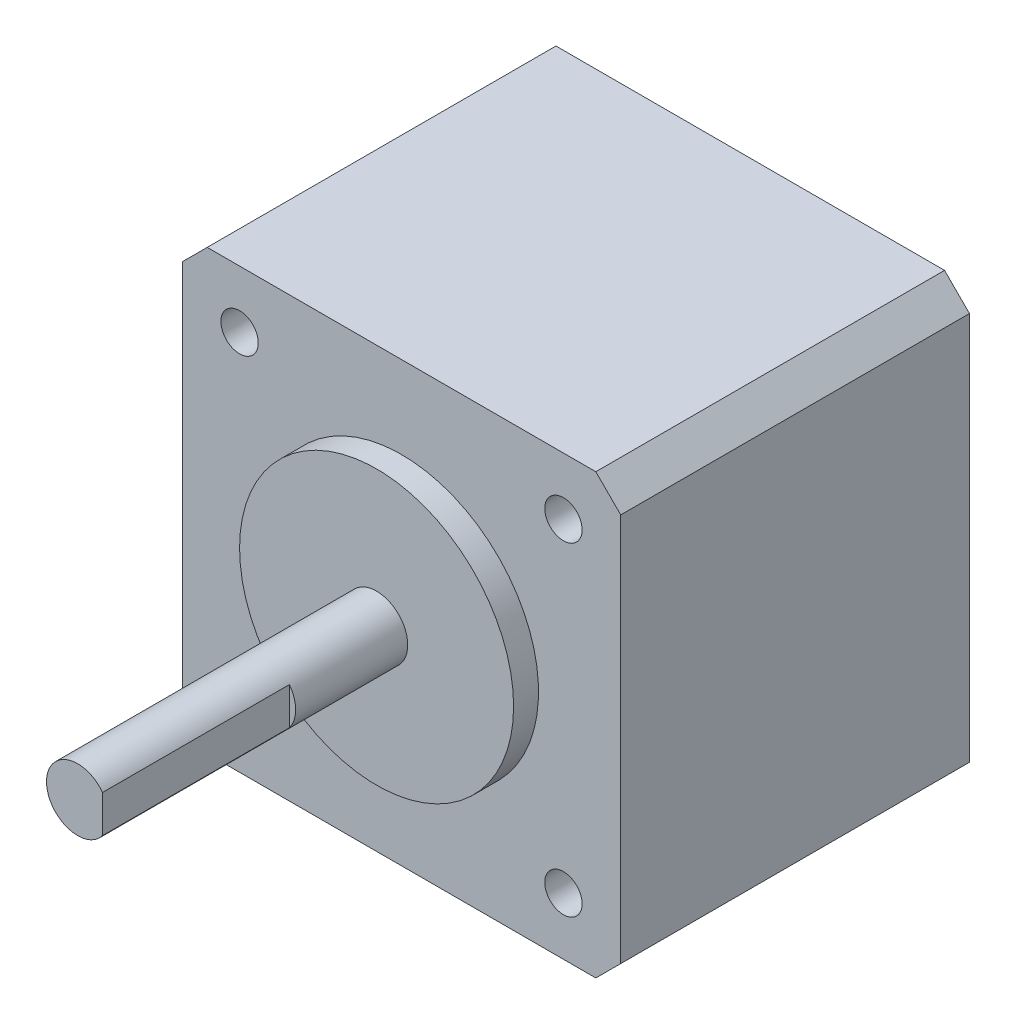
ISO-10303-21;
HEADER;
FILE_DESCRIPTION(('STEP AP214'),'2;1');
FILE_NAME('part.step','',(''),(''),'','','');
FILE_SCHEMA(('AUTOMOTIVE_DESIGN { 1 0 10303 214 1 1 1 1 }'));
ENDSEC;
DATA;
#1=APPLICATION_CONTEXT('core data for automotive mechanical design processes');
#2=APPLICATION_PROTOCOL_DEFINITION('international standard','automotive_design',2000,#1);
#3=PRODUCT_CONTEXT('',#1,'mechanical');
#4=PRODUCT('Part','Part','',(#3));
#5=PRODUCT_RELATED_PRODUCT_CATEGORY('part','',(#4));
#6=PRODUCT_DEFINITION_FORMATION('','',#4);
#7=PRODUCT_DEFINITION_CONTEXT('part definition',#1,'design');
#8=PRODUCT_DEFINITION('design','',#6,#7);
#9=PRODUCT_DEFINITION_SHAPE('','',#8);
#10=(LENGTH_UNIT() NAMED_UNIT(*) SI_UNIT(.MILLI.,.METRE.));
#11=(NAMED_UNIT(*) PLANE_ANGLE_UNIT() SI_UNIT($,.RADIAN.));
#12=(NAMED_UNIT(*) SI_UNIT($,.STERADIAN.) SOLID_ANGLE_UNIT());
#13=UNCERTAINTY_MEASURE_WITH_UNIT(LENGTH_MEASURE(1.E-05),#10,'distance_accuracy_value','');
#14=(GEOMETRIC_REPRESENTATION_CONTEXT(3) GLOBAL_UNCERTAINTY_ASSIGNED_CONTEXT((#13)) GLOBAL_UNIT_ASSIGNED_CONTEXT((#10,
#11,#12)) REPRESENTATION_CONTEXT('',''));
#15=CARTESIAN_POINT('',(0.,0.,0.));
#16=DIRECTION('',(0.,0.,1.));
#17=DIRECTION('',(1.,0.,0.));
#18=AXIS2_PLACEMENT_3D('',#15,#16,#17);
#19=CARTESIAN_POINT('',(0.,0.,28.));
#20=DIRECTION('',(1.,0.,0.));
#21=DIRECTION('',(0.,0.,-1.));
#22=AXIS2_PLACEMENT_3D('',#19,#20,#21);
#23=PLANE('',#22);
#24=DIRECTION('',(0.,-1.,0.));
#25=VECTOR('',#24,1.);
#26=CARTESIAN_POINT('',(0.,0.,0.));
#27=LINE('',#26,#25);
#28=CARTESIAN_POINT('',(0.,33.2,0.));
#29=VERTEX_POINT('',#28);
#30=CARTESIAN_POINT('',(0.,2.00000000000002,0.));
#31=VERTEX_POINT('',#30);
#32=EDGE_CURVE('E157',#29,#31,#27,.T.);
#33=ORIENTED_EDGE('',*,*,#32,.T.);
#34=DIRECTION('',(0.,0.,1.));
#35=VECTOR('',#34,1.);
#36=CARTESIAN_POINT('',(0.,2.00000000000002,28.));
#37=LINE('',#36,#35);
#38=CARTESIAN_POINT('',(0.,2.00000000000002,28.));
#39=VERTEX_POINT('',#38);
#40=EDGE_CURVE('E197',#31,#39,#37,.T.);
#41=ORIENTED_EDGE('',*,*,#40,.T.);
#42=DIRECTION('',(0.,-1.,0.));
#43=VECTOR('',#42,1.);
#44=CARTESIAN_POINT('',(0.,0.,28.));
#45=LINE('',#44,#43);
#46=CARTESIAN_POINT('',(0.,33.2,28.));
#47=VERTEX_POINT('',#46);
#48=EDGE_CURVE('E158',#47,#39,#45,.T.);
#49=ORIENTED_EDGE('',*,*,#48,.F.);
#50=DIRECTION('',(0.,0.,-1.));
#51=VECTOR('',#50,1.);
#52=CARTESIAN_POINT('',(0.,33.2,28.));
#53=LINE('',#52,#51);
#54=EDGE_CURVE('E194',#47,#29,#53,.T.);
#55=ORIENTED_EDGE('',*,*,#54,.T.);
#56=EDGE_LOOP('',(#33,#41,#49,#55));
#57=FACE_BOUND('',#56,.T.);
#58=ADVANCED_FACE('F49',(#57),#23,.F.);
#59=CARTESIAN_POINT('',(0.,0.,28.));
#60=DIRECTION('',(0.,1.,0.));
#61=DIRECTION('',(0.,0.,1.));
#62=AXIS2_PLACEMENT_3D('',#59,#60,#61);
#63=PLANE('',#62);
#64=DIRECTION('',(1.,0.,0.));
#65=VECTOR('',#64,1.);
#66=CARTESIAN_POINT('',(0.,0.,28.));
#67=LINE('',#66,#65);
#68=CARTESIAN_POINT('',(2.00000000000001,0.,28.));
#69=VERTEX_POINT('',#68);
#70=CARTESIAN_POINT('',(33.2,0.,28.));
#71=VERTEX_POINT('',#70);
#72=EDGE_CURVE('E161',#69,#71,#67,.T.);
#73=ORIENTED_EDGE('',*,*,#72,.F.);
#74=DIRECTION('',(0.,0.,-1.));
#75=VECTOR('',#74,1.);
#76=CARTESIAN_POINT('',(2.00000000000001,0.,28.));
#77=LINE('',#76,#75);
#78=CARTESIAN_POINT('',(2.00000000000001,0.,0.));
#79=VERTEX_POINT('',#78);
#80=EDGE_CURVE('E183',#69,#79,#77,.T.);
#81=ORIENTED_EDGE('',*,*,#80,.T.);
#82=DIRECTION('',(1.,0.,0.));
#83=VECTOR('',#82,1.);
#84=CARTESIAN_POINT('',(0.,0.,0.));
#85=LINE('',#84,#83);
#86=CARTESIAN_POINT('',(33.2,0.,0.));
#87=VERTEX_POINT('',#86);
#88=EDGE_CURVE('E172',#79,#87,#85,.T.);
#89=ORIENTED_EDGE('',*,*,#88,.T.);
#90=DIRECTION('',(0.,0.,1.));
#91=VECTOR('',#90,1.);
#92=CARTESIAN_POINT('',(33.2,0.,28.));
#93=LINE('',#92,#91);
#94=EDGE_CURVE('E181',#87,#71,#93,.T.);
#95=ORIENTED_EDGE('',*,*,#94,.T.);
#96=EDGE_LOOP('',(#73,#81,#89,#95));
#97=FACE_BOUND('',#96,.T.);
#98=ADVANCED_FACE('F234',(#97),#63,.F.);
#99=CARTESIAN_POINT('',(35.2,0.,28.));
#100=DIRECTION('',(-1.,0.,0.));
#101=DIRECTION('',(0.,0.,1.));
#102=AXIS2_PLACEMENT_3D('',#99,#100,#101);
#103=PLANE('',#102);
#104=DIRECTION('',(0.,1.,0.));
#105=VECTOR('',#104,1.);
#106=CARTESIAN_POINT('',(35.2,0.,28.));
#107=LINE('',#106,#105);
#108=CARTESIAN_POINT('',(35.2,2.00000000000001,28.));
#109=VERTEX_POINT('',#108);
#110=CARTESIAN_POINT('',(35.2,33.2,28.));
#111=VERTEX_POINT('',#110);
#112=EDGE_CURVE('E165',#109,#111,#107,.T.);
#113=ORIENTED_EDGE('',*,*,#112,.F.);
#114=DIRECTION('',(0.,0.,-1.));
#115=VECTOR('',#114,1.);
#116=CARTESIAN_POINT('',(35.2,2.00000000000001,28.));
#117=LINE('',#116,#115);
#118=CARTESIAN_POINT('',(35.2,2.00000000000002,0.));
#119=VERTEX_POINT('',#118);
#120=EDGE_CURVE('E208',#109,#119,#117,.T.);
#121=ORIENTED_EDGE('',*,*,#120,.T.);
#122=DIRECTION('',(0.,1.,0.));
#123=VECTOR('',#122,1.);
#124=CARTESIAN_POINT('',(35.2,0.,0.));
#125=LINE('',#124,#123);
#126=CARTESIAN_POINT('',(35.2,33.2,0.));
#127=VERTEX_POINT('',#126);
#128=EDGE_CURVE('E175',#119,#127,#125,.T.);
#129=ORIENTED_EDGE('',*,*,#128,.T.);
#130=DIRECTION('',(0.,0.,1.));
#131=VECTOR('',#130,1.);
#132=CARTESIAN_POINT('',(35.2,33.2,28.));
#133=LINE('',#132,#131);
#134=EDGE_CURVE('E206',#127,#111,#133,.T.);
#135=ORIENTED_EDGE('',*,*,#134,.T.);
#136=EDGE_LOOP('',(#113,#121,#129,#135));
#137=FACE_BOUND('',#136,.T.);
#138=ADVANCED_FACE('F242',(#137),#103,.F.);
#139=CARTESIAN_POINT('',(0.,35.2,28.));
#140=DIRECTION('',(0.,-1.,0.));
#141=DIRECTION('',(0.,0.,-1.));
#142=AXIS2_PLACEMENT_3D('',#139,#140,#141);
#143=PLANE('',#142);
#144=DIRECTION('',(-1.,0.,0.));
#145=VECTOR('',#144,1.);
#146=CARTESIAN_POINT('',(0.,35.2,0.));
#147=LINE('',#146,#145);
#148=CARTESIAN_POINT('',(33.2,35.2,0.));
#149=VERTEX_POINT('',#148);
#150=CARTESIAN_POINT('',(2.00000000000002,35.2,0.));
#151=VERTEX_POINT('',#150);
#152=EDGE_CURVE('E162',#149,#151,#147,.T.);
#153=ORIENTED_EDGE('',*,*,#152,.T.);
#154=DIRECTION('',(0.,0.,1.));
#155=VECTOR('',#154,1.);
#156=CARTESIAN_POINT('',(2.00000000000002,35.2,28.));
#157=LINE('',#156,#155);
#158=CARTESIAN_POINT('',(2.00000000000002,35.2,28.));
#159=VERTEX_POINT('',#158);
#160=EDGE_CURVE('E13',#151,#159,#157,.T.);
#161=ORIENTED_EDGE('',*,*,#160,.T.);
#162=DIRECTION('',(-1.,0.,0.));
#163=VECTOR('',#162,1.);
#164=CARTESIAN_POINT('',(0.,35.2,28.));
#165=LINE('',#164,#163);
#166=CARTESIAN_POINT('',(33.2,35.2,28.));
#167=VERTEX_POINT('',#166);
#168=EDGE_CURVE('E167',#167,#159,#165,.T.);
#169=ORIENTED_EDGE('',*,*,#168,.F.);
#170=DIRECTION('',(0.,0.,-1.));
#171=VECTOR('',#170,1.);
#172=CARTESIAN_POINT('',(33.2,35.2,28.));
#173=LINE('',#172,#171);
#174=EDGE_CURVE('E57',#167,#149,#173,.T.);
#175=ORIENTED_EDGE('',*,*,#174,.T.);
#176=EDGE_LOOP('',(#153,#161,#169,#175));
#177=FACE_BOUND('',#176,.T.);
#178=ADVANCED_FACE('F213',(#177),#143,.F.);
#179=CARTESIAN_POINT('',(0.,0.,28.));
#180=DIRECTION('',(0.,0.,-1.));
#181=DIRECTION('',(-1.,0.,0.));
#182=AXIS2_PLACEMENT_3D('',#179,#180,#181);
#183=PLANE('',#182);
#184=CARTESIAN_POINT('',(4.6,30.6,28.));
#185=DIRECTION('',(0.,0.,1.));
#186=DIRECTION('',(-1.,0.,0.));
#187=AXIS2_PLACEMENT_3D('',#184,#185,#186);
#188=CIRCLE('',#187,1.5);
#189=CARTESIAN_POINT('',(3.1,30.6,28.));
#190=VERTEX_POINT('',#189);
#191=EDGE_CURVE('E490',#190,#190,#188,.T.);
#192=ORIENTED_EDGE('',*,*,#191,.F.);
#193=EDGE_LOOP('',(#192));
#194=FACE_BOUND('',#193,.T.);
#195=CARTESIAN_POINT('',(4.6,4.59999999999999,28.));
#196=DIRECTION('',(0.,0.,1.));
#197=DIRECTION('',(1.,0.,0.));
#198=AXIS2_PLACEMENT_3D('',#195,#196,#197);
#199=CIRCLE('',#198,1.5);
#200=CARTESIAN_POINT('',(6.1,4.59999999999999,28.));
#201=VERTEX_POINT('',#200);
#202=EDGE_CURVE('E484',#201,#201,#199,.T.);
#203=ORIENTED_EDGE('',*,*,#202,.F.);
#204=EDGE_LOOP('',(#203));
#205=FACE_BOUND('',#204,.T.);
#206=CARTESIAN_POINT('',(30.6,4.59999999999999,28.));
#207=DIRECTION('',(0.,0.,1.));
#208=DIRECTION('',(-1.,0.,0.));
#209=AXIS2_PLACEMENT_3D('',#206,#207,#208);
#210=CIRCLE('',#209,1.5);
#211=CARTESIAN_POINT('',(29.1,4.59999999999999,28.));
#212=VERTEX_POINT('',#211);
#213=EDGE_CURVE('E478',#212,#212,#210,.T.);
#214=ORIENTED_EDGE('',*,*,#213,.F.);
#215=EDGE_LOOP('',(#214));
#216=FACE_BOUND('',#215,.T.);
#217=CARTESIAN_POINT('',(30.6,30.6,28.));
#218=DIRECTION('',(0.,0.,1.));
#219=DIRECTION('',(1.,0.,0.));
#220=AXIS2_PLACEMENT_3D('',#217,#218,#219);
#221=CIRCLE('',#220,1.5);
#222=CARTESIAN_POINT('',(32.1,30.6,28.));
#223=VERTEX_POINT('',#222);
#224=EDGE_CURVE('E472',#223,#223,#221,.T.);
#225=ORIENTED_EDGE('',*,*,#224,.F.);
#226=EDGE_LOOP('',(#225));
#227=FACE_BOUND('',#226,.T.);
#228=CARTESIAN_POINT('',(17.6,17.6,28.));
#229=DIRECTION('',(0.,0.,-1.));
#230=DIRECTION('',(-1.,0.,0.));
#231=AXIS2_PLACEMENT_3D('',#228,#229,#230);
#232=CIRCLE('',#231,11.);
#233=CARTESIAN_POINT('',(6.6,17.6,28.));
#234=VERTEX_POINT('',#233);
#235=EDGE_CURVE('E169',#234,#234,#232,.F.);
#236=ORIENTED_EDGE('',*,*,#235,.F.);
#237=EDGE_LOOP('',(#236));
#238=FACE_BOUND('',#237,.T.);
#239=ORIENTED_EDGE('',*,*,#48,.T.);
#240=DIRECTION('',(-0.707106781186546,0.707106781186549,0.));
#241=VECTOR('',#240,1.);
#242=CARTESIAN_POINT('',(2.00000000000001,0.,28.));
#243=LINE('',#242,#241);
#244=EDGE_CURVE('E204',#39,#69,#243,.F.);
#245=ORIENTED_EDGE('',*,*,#244,.T.);
#246=ORIENTED_EDGE('',*,*,#72,.T.);
#247=DIRECTION('',(-0.707106781186549,-0.707106781186546,0.));
#248=VECTOR('',#247,1.);
#249=CARTESIAN_POINT('',(35.2,2.00000000000001,28.));
#250=LINE('',#249,#248);
#251=EDGE_CURVE('E202',#71,#109,#250,.F.);
#252=ORIENTED_EDGE('',*,*,#251,.T.);
#253=ORIENTED_EDGE('',*,*,#112,.T.);
#254=DIRECTION('',(0.707106781186546,-0.707106781186549,0.));
#255=VECTOR('',#254,1.);
#256=CARTESIAN_POINT('',(33.2,35.2,28.));
#257=LINE('',#256,#255);
#258=EDGE_CURVE('E69',#111,#167,#257,.F.);
#259=ORIENTED_EDGE('',*,*,#258,.T.);
#260=ORIENTED_EDGE('',*,*,#168,.T.);
#261=DIRECTION('',(0.707106781186549,0.707106781186546,0.));
#262=VECTOR('',#261,1.);
#263=CARTESIAN_POINT('',(0.,33.2,28.));
#264=LINE('',#263,#262);
#265=EDGE_CURVE('E200',#159,#47,#264,.F.);
#266=ORIENTED_EDGE('',*,*,#265,.T.);
#267=EDGE_LOOP('',(#239,#245,#246,#252,#253,#259,#260,#266));
#268=FACE_BOUND('',#267,.T.);
#269=ADVANCED_FACE('F228',(#194,#205,#216,#227,#238,#268),#183,.F.);
#270=CARTESIAN_POINT('',(0.,0.,0.));
#271=DIRECTION('',(0.,0.,-1.));
#272=DIRECTION('',(-1.,0.,0.));
#273=AXIS2_PLACEMENT_3D('',#270,#271,#272);
#274=PLANE('',#273);
#275=ORIENTED_EDGE('',*,*,#88,.F.);
#276=DIRECTION('',(0.707106781186546,-0.707106781186549,0.));
#277=VECTOR('',#276,1.);
#278=CARTESIAN_POINT('',(1.00000000000001,1.,0.));
#279=LINE('',#278,#277);
#280=EDGE_CURVE('E192',#79,#31,#279,.F.);
#281=ORIENTED_EDGE('',*,*,#280,.T.);
#282=ORIENTED_EDGE('',*,*,#32,.F.);
#283=DIRECTION('',(-0.707106781186549,-0.707106781186546,0.));
#284=VECTOR('',#283,1.);
#285=CARTESIAN_POINT('',(-16.6,16.6000000000001,0.));
#286=LINE('',#285,#284);
#287=EDGE_CURVE('E188',#29,#151,#286,.F.);
#288=ORIENTED_EDGE('',*,*,#287,.T.);
#289=ORIENTED_EDGE('',*,*,#152,.F.);
#290=DIRECTION('',(-0.707106781186546,0.707106781186549,0.));
#291=VECTOR('',#290,1.);
#292=CARTESIAN_POINT('',(34.2000000000001,34.1999999999999,0.));
#293=LINE('',#292,#291);
#294=EDGE_CURVE('E186',#149,#127,#293,.F.);
#295=ORIENTED_EDGE('',*,*,#294,.T.);
#296=ORIENTED_EDGE('',*,*,#128,.F.);
#297=DIRECTION('',(0.707106781186549,0.707106781186546,0.));
#298=VECTOR('',#297,1.);
#299=CARTESIAN_POINT('',(16.5999999999999,-16.6,0.));
#300=LINE('',#299,#298);
#301=EDGE_CURVE('E190',#119,#87,#300,.F.);
#302=ORIENTED_EDGE('',*,*,#301,.T.);
#303=EDGE_LOOP('',(#275,#281,#282,#288,#289,#295,#296,#302));
#304=FACE_BOUND('',#303,.T.);
#305=ADVANCED_FACE('F217',(#304),#274,.T.);
#306=CARTESIAN_POINT('',(17.6,17.6,30.));
#307=DIRECTION('',(0.,0.,-1.));
#308=DIRECTION('',(-1.,0.,0.));
#309=AXIS2_PLACEMENT_3D('',#306,#307,#308);
#310=CYLINDRICAL_SURFACE('',#309,11.);
#311=CARTESIAN_POINT('',(17.6,17.6,30.));
#312=DIRECTION('',(0.,0.,1.));
#313=DIRECTION('',(1.,0.,0.));
#314=AXIS2_PLACEMENT_3D('',#311,#312,#313);
#315=CIRCLE('',#314,11.);
#316=CARTESIAN_POINT('',(28.6,17.6,30.));
#317=VERTEX_POINT('',#316);
#318=EDGE_CURVE('E152',#317,#317,#315,.T.);
#319=ORIENTED_EDGE('',*,*,#318,.F.);
#320=EDGE_LOOP('',(#319));
#321=FACE_BOUND('',#320,.T.);
#322=ORIENTED_EDGE('',*,*,#235,.T.);
#323=EDGE_LOOP('',(#322));
#324=FACE_BOUND('',#323,.T.);
#325=ADVANCED_FACE('F383',(#321,#324),#310,.T.);
#326=CARTESIAN_POINT('',(17.6,17.6,30.));
#327=DIRECTION('',(0.,0.,1.));
#328=DIRECTION('',(1.,0.,0.));
#329=AXIS2_PLACEMENT_3D('',#326,#327,#328);
#330=PLANE('',#329);
#331=CARTESIAN_POINT('',(17.6,17.6,30.));
#332=DIRECTION('',(0.,0.,1.));
#333=DIRECTION('',(1.,0.,0.));
#334=AXIS2_PLACEMENT_3D('',#331,#332,#333);
#335=CIRCLE('',#334,2.5);
#336=CARTESIAN_POINT('',(20.1,17.6,30.));
#337=VERTEX_POINT('',#336);
#338=EDGE_CURVE('E147',#337,#337,#335,.T.);
#339=ORIENTED_EDGE('',*,*,#338,.F.);
#340=EDGE_LOOP('',(#339));
#341=FACE_BOUND('',#340,.T.);
#342=ORIENTED_EDGE('',*,*,#318,.T.);
#343=EDGE_LOOP('',(#342));
#344=FACE_BOUND('',#343,.T.);
#345=ADVANCED_FACE('F380',(#341,#344),#330,.T.);
#346=CARTESIAN_POINT('',(17.6,17.6,54.));
#347=DIRECTION('',(0.,0.,-1.));
#348=DIRECTION('',(-1.,0.,0.));
#349=AXIS2_PLACEMENT_3D('',#346,#347,#348);
#350=CYLINDRICAL_SURFACE('',#349,2.5);
#351=CARTESIAN_POINT('',(17.6,17.6,54.));
#352=DIRECTION('',(0.,0.,1.));
#353=DIRECTION('',(1.,0.,0.));
#354=AXIS2_PLACEMENT_3D('',#351,#352,#353);
#355=CIRCLE('',#354,2.5);
#356=CARTESIAN_POINT('',(19.6,19.1,54.));
#357=VERTEX_POINT('',#356);
#358=CARTESIAN_POINT('',(19.6,16.1,54.));
#359=VERTEX_POINT('',#358);
#360=EDGE_CURVE('E145',#357,#359,#355,.T.);
#361=ORIENTED_EDGE('',*,*,#360,.F.);
#362=DIRECTION('',(0.,0.,1.));
#363=VECTOR('',#362,1.);
#364=CARTESIAN_POINT('',(19.6,19.1,39.));
#365=LINE('',#364,#363);
#366=CARTESIAN_POINT('',(19.6,19.1,39.));
#367=VERTEX_POINT('',#366);
#368=EDGE_CURVE('E137',#367,#357,#365,.T.);
#369=ORIENTED_EDGE('',*,*,#368,.F.);
#370=CARTESIAN_POINT('',(17.6,17.6,39.));
#371=DIRECTION('',(0.,0.,1.));
#372=DIRECTION('',(1.,0.,0.));
#373=AXIS2_PLACEMENT_3D('',#370,#371,#372);
#374=CIRCLE('',#373,2.5);
#375=CARTESIAN_POINT('',(19.6,16.1,39.));
#376=VERTEX_POINT('',#375);
#377=EDGE_CURVE('E126',#376,#367,#374,.T.);
#378=ORIENTED_EDGE('',*,*,#377,.F.);
#379=DIRECTION('',(0.,0.,1.));
#380=VECTOR('',#379,1.);
#381=CARTESIAN_POINT('',(19.6,16.1,39.));
#382=LINE('',#381,#380);
#383=EDGE_CURVE('E139',#376,#359,#382,.T.);
#384=ORIENTED_EDGE('',*,*,#383,.T.);
#385=EDGE_LOOP('',(#361,#369,#378,#384));
#386=FACE_BOUND('',#385,.T.);
#387=ORIENTED_EDGE('',*,*,#338,.T.);
#388=EDGE_LOOP('',(#387));
#389=FACE_BOUND('',#388,.T.);
#390=ADVANCED_FACE('F142',(#386,#389),#350,.T.);
#391=CARTESIAN_POINT('',(17.6,17.6,54.));
#392=DIRECTION('',(0.,0.,1.));
#393=DIRECTION('',(1.,0.,0.));
#394=AXIS2_PLACEMENT_3D('',#391,#392,#393);
#395=PLANE('',#394);
#396=DIRECTION('',(0.,-1.,0.));
#397=VECTOR('',#396,1.);
#398=CARTESIAN_POINT('',(19.6,19.1,54.));
#399=LINE('',#398,#397);
#400=EDGE_CURVE('E133',#357,#359,#399,.T.);
#401=ORIENTED_EDGE('',*,*,#400,.F.);
#402=ORIENTED_EDGE('',*,*,#360,.T.);
#403=EDGE_LOOP('',(#401,#402));
#404=FACE_BOUND('',#403,.T.);
#405=ADVANCED_FACE('F374',(#404),#395,.T.);
#406=CARTESIAN_POINT('',(19.6,19.1,39.));
#407=DIRECTION('',(-1.,0.,0.));
#408=DIRECTION('',(0.,-1.,0.));
#409=AXIS2_PLACEMENT_3D('',#406,#407,#408);
#410=PLANE('',#409);
#411=ORIENTED_EDGE('',*,*,#400,.T.);
#412=ORIENTED_EDGE('',*,*,#383,.F.);
#413=DIRECTION('',(0.,-1.,0.));
#414=VECTOR('',#413,1.);
#415=CARTESIAN_POINT('',(19.6,19.1,39.));
#416=LINE('',#415,#414);
#417=EDGE_CURVE('E129',#367,#376,#416,.T.);
#418=ORIENTED_EDGE('',*,*,#417,.F.);
#419=ORIENTED_EDGE('',*,*,#368,.T.);
#420=EDGE_LOOP('',(#411,#412,#418,#419));
#421=FACE_BOUND('',#420,.T.);
#422=ADVANCED_FACE('F136',(#421),#410,.F.);
#423=CARTESIAN_POINT('',(17.6,17.6,39.));
#424=DIRECTION('',(0.,0.,1.));
#425=DIRECTION('',(1.,0.,0.));
#426=AXIS2_PLACEMENT_3D('',#423,#424,#425);
#427=PLANE('',#426);
#428=ORIENTED_EDGE('',*,*,#377,.T.);
#429=ORIENTED_EDGE('',*,*,#417,.T.);
#430=EDGE_LOOP('',(#428,#429));
#431=FACE_BOUND('',#430,.T.);
#432=ADVANCED_FACE('F128',(#431),#427,.T.);
#433=CARTESIAN_POINT('',(2.00000000000001,0.,28.));
#434=DIRECTION('',(0.707106781186549,0.707106781186546,0.));
#435=DIRECTION('',(0.,0.,-1.));
#436=AXIS2_PLACEMENT_3D('',#433,#434,#435);
#437=PLANE('',#436);
#438=ORIENTED_EDGE('',*,*,#244,.F.);
#439=ORIENTED_EDGE('',*,*,#40,.F.);
#440=ORIENTED_EDGE('',*,*,#280,.F.);
#441=ORIENTED_EDGE('',*,*,#80,.F.);
#442=EDGE_LOOP('',(#438,#439,#440,#441));
#443=FACE_BOUND('',#442,.T.);
#444=ADVANCED_FACE('F232',(#443),#437,.F.);
#445=CARTESIAN_POINT('',(35.2,2.00000000000001,28.));
#446=DIRECTION('',(-0.707106781186546,0.707106781186549,0.));
#447=DIRECTION('',(0.,0.,-1.));
#448=AXIS2_PLACEMENT_3D('',#445,#446,#447);
#449=PLANE('',#448);
#450=ORIENTED_EDGE('',*,*,#251,.F.);
#451=ORIENTED_EDGE('',*,*,#94,.F.);
#452=ORIENTED_EDGE('',*,*,#301,.F.);
#453=ORIENTED_EDGE('',*,*,#120,.F.);
#454=EDGE_LOOP('',(#450,#451,#452,#453));
#455=FACE_BOUND('',#454,.T.);
#456=ADVANCED_FACE('F239',(#455),#449,.F.);
#457=CARTESIAN_POINT('',(0.,33.2,28.));
#458=DIRECTION('',(0.707106781186546,-0.707106781186549,0.));
#459=DIRECTION('',(0.,0.,-1.));
#460=AXIS2_PLACEMENT_3D('',#457,#458,#459);
#461=PLANE('',#460);
#462=ORIENTED_EDGE('',*,*,#265,.F.);
#463=ORIENTED_EDGE('',*,*,#160,.F.);
#464=ORIENTED_EDGE('',*,*,#287,.F.);
#465=ORIENTED_EDGE('',*,*,#54,.F.);
#466=EDGE_LOOP('',(#462,#463,#464,#465));
#467=FACE_BOUND('',#466,.T.);
#468=ADVANCED_FACE('F223',(#467),#461,.F.);
#469=CARTESIAN_POINT('',(33.2,35.2,28.));
#470=DIRECTION('',(-0.707106781186549,-0.707106781186546,0.));
#471=DIRECTION('',(0.,0.,-1.));
#472=AXIS2_PLACEMENT_3D('',#469,#470,#471);
#473=PLANE('',#472);
#474=ORIENTED_EDGE('',*,*,#258,.F.);
#475=ORIENTED_EDGE('',*,*,#134,.F.);
#476=ORIENTED_EDGE('',*,*,#294,.F.);
#477=ORIENTED_EDGE('',*,*,#174,.F.);
#478=EDGE_LOOP('',(#474,#475,#476,#477));
#479=FACE_BOUND('',#478,.T.);
#480=ADVANCED_FACE('F51',(#479),#473,.F.);
#481=CARTESIAN_POINT('',(30.6,30.6,23.5));
#482=DIRECTION('',(0.,0.,1.));
#483=DIRECTION('',(1.,0.,0.));
#484=AXIS2_PLACEMENT_3D('',#481,#482,#483);
#485=CYLINDRICAL_SURFACE('',#484,1.5);
#486=CARTESIAN_POINT('',(30.6,30.6,23.5));
#487=DIRECTION('',(0.,0.,1.));
#488=DIRECTION('',(1.,0.,0.));
#489=AXIS2_PLACEMENT_3D('',#486,#487,#488);
#490=CIRCLE('',#489,1.5);
#491=CARTESIAN_POINT('',(32.1,30.6,23.5));
#492=VERTEX_POINT('',#491);
#493=EDGE_CURVE('E470',#492,#492,#490,.T.);
#494=ORIENTED_EDGE('',*,*,#493,.F.);
#495=EDGE_LOOP('',(#494));
#496=FACE_BOUND('',#495,.T.);
#497=ORIENTED_EDGE('',*,*,#224,.T.);
#498=EDGE_LOOP('',(#497));
#499=FACE_BOUND('',#498,.T.);
#500=ADVANCED_FACE('F245',(#496,#499),#485,.F.);
#501=CARTESIAN_POINT('',(30.6,30.6,23.5));
#502=DIRECTION('',(0.,0.,1.));
#503=DIRECTION('',(1.,0.,0.));
#504=AXIS2_PLACEMENT_3D('',#501,#502,#503);
#505=PLANE('',#504);
#506=ORIENTED_EDGE('',*,*,#493,.T.);
#507=EDGE_LOOP('',(#506));
#508=FACE_BOUND('',#507,.T.);
#509=ADVANCED_FACE('F250',(#508),#505,.T.);
#510=CARTESIAN_POINT('',(30.6,4.59999999999999,23.5));
#511=DIRECTION('',(0.,0.,1.));
#512=DIRECTION('',(1.,0.,0.));
#513=AXIS2_PLACEMENT_3D('',#510,#511,#512);
#514=CYLINDRICAL_SURFACE('',#513,1.5);
#515=CARTESIAN_POINT('',(30.6,4.59999999999999,23.5));
#516=DIRECTION('',(0.,0.,1.));
#517=DIRECTION('',(-1.,0.,0.));
#518=AXIS2_PLACEMENT_3D('',#515,#516,#517);
#519=CIRCLE('',#518,1.5);
#520=CARTESIAN_POINT('',(29.1,4.59999999999999,23.5));
#521=VERTEX_POINT('',#520);
#522=EDGE_CURVE('E476',#521,#521,#519,.T.);
#523=ORIENTED_EDGE('',*,*,#522,.F.);
#524=EDGE_LOOP('',(#523));
#525=FACE_BOUND('',#524,.T.);
#526=ORIENTED_EDGE('',*,*,#213,.T.);
#527=EDGE_LOOP('',(#526));
#528=FACE_BOUND('',#527,.T.);
#529=ADVANCED_FACE('F305',(#525,#528),#514,.F.);
#530=CARTESIAN_POINT('',(30.6,4.59999999999999,23.5));
#531=DIRECTION('',(0.,0.,-1.));
#532=DIRECTION('',(-1.,0.,0.));
#533=AXIS2_PLACEMENT_3D('',#530,#531,#532);
#534=PLANE('',#533);
#535=ORIENTED_EDGE('',*,*,#522,.T.);
#536=EDGE_LOOP('',(#535));
#537=FACE_BOUND('',#536,.T.);
#538=ADVANCED_FACE('F315',(#537),#534,.F.);
#539=CARTESIAN_POINT('',(4.6,4.59999999999999,23.5));
#540=DIRECTION('',(0.,0.,1.));
#541=DIRECTION('',(1.,0.,0.));
#542=AXIS2_PLACEMENT_3D('',#539,#540,#541);
#543=CYLINDRICAL_SURFACE('',#542,1.5);
#544=CARTESIAN_POINT('',(4.6,4.59999999999999,23.5));
#545=DIRECTION('',(0.,0.,1.));
#546=DIRECTION('',(1.,0.,0.));
#547=AXIS2_PLACEMENT_3D('',#544,#545,#546);
#548=CIRCLE('',#547,1.5);
#549=CARTESIAN_POINT('',(6.1,4.59999999999999,23.5));
#550=VERTEX_POINT('',#549);
#551=EDGE_CURVE('E481',#550,#550,#548,.T.);
#552=ORIENTED_EDGE('',*,*,#551,.F.);
#553=EDGE_LOOP('',(#552));
#554=FACE_BOUND('',#553,.T.);
#555=ORIENTED_EDGE('',*,*,#202,.T.);
#556=EDGE_LOOP('',(#555));
#557=FACE_BOUND('',#556,.T.);
#558=ADVANCED_FACE('F325',(#554,#557),#543,.F.);
#559=CARTESIAN_POINT('',(4.6,4.59999999999999,23.5));
#560=DIRECTION('',(0.,0.,1.));
#561=DIRECTION('',(1.,0.,0.));
#562=AXIS2_PLACEMENT_3D('',#559,#560,#561);
#563=PLANE('',#562);
#564=ORIENTED_EDGE('',*,*,#551,.T.);
#565=EDGE_LOOP('',(#564));
#566=FACE_BOUND('',#565,.T.);
#567=ADVANCED_FACE('F335',(#566),#563,.T.);
#568=CARTESIAN_POINT('',(4.6,30.6,23.5));
#569=DIRECTION('',(0.,0.,1.));
#570=DIRECTION('',(1.,0.,0.));
#571=AXIS2_PLACEMENT_3D('',#568,#569,#570);
#572=CYLINDRICAL_SURFACE('',#571,1.5);
#573=CARTESIAN_POINT('',(4.6,30.6,23.5));
#574=DIRECTION('',(0.,0.,1.));
#575=DIRECTION('',(-1.,0.,0.));
#576=AXIS2_PLACEMENT_3D('',#573,#574,#575);
#577=CIRCLE('',#576,1.5);
#578=CARTESIAN_POINT('',(3.1,30.6,23.5));
#579=VERTEX_POINT('',#578);
#580=EDGE_CURVE('E487',#579,#579,#577,.T.);
#581=ORIENTED_EDGE('',*,*,#580,.F.);
#582=EDGE_LOOP('',(#581));
#583=FACE_BOUND('',#582,.T.);
#584=ORIENTED_EDGE('',*,*,#191,.T.);
#585=EDGE_LOOP('',(#584));
#586=FACE_BOUND('',#585,.T.);
#587=ADVANCED_FACE('F345',(#583,#586),#572,.F.);
#588=CARTESIAN_POINT('',(4.6,30.6,23.5));
#589=DIRECTION('',(0.,0.,-1.));
#590=DIRECTION('',(-1.,0.,0.));
#591=AXIS2_PLACEMENT_3D('',#588,#589,#590);
#592=PLANE('',#591);
#593=ORIENTED_EDGE('',*,*,#580,.T.);
#594=EDGE_LOOP('',(#593));
#595=FACE_BOUND('',#594,.T.);
#596=ADVANCED_FACE('F355',(#595),#592,.F.);
#597=CLOSED_SHELL('',(#58,#98,#138,#178,#269,#305,#325,#345,#390,#405,#422,#432,#444,#456,#468,
#480,#500,#509,#529,#538,#558,#567,#587,#596));
#598=MANIFOLD_SOLID_BREP('B2',#597);
#599=ADVANCED_BREP_SHAPE_REPRESENTATION('',(#18,#598),#14);
#600=SHAPE_DEFINITION_REPRESENTATION(#9,#599);
ENDSEC;
END-ISO-10303-21;
